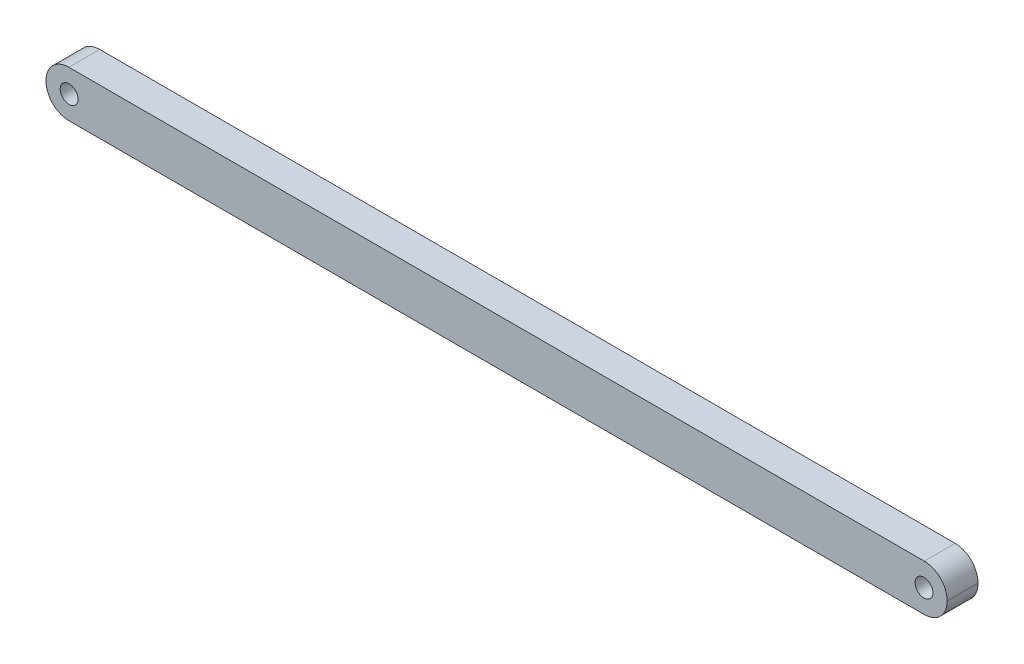
ISO-10303-21;
HEADER;
FILE_DESCRIPTION(('STEP AP214'),'2;1');
FILE_NAME('part.step','',(''),(''),'','','');
FILE_SCHEMA(('AUTOMOTIVE_DESIGN { 1 0 10303 214 1 1 1 1 }'));
ENDSEC;
DATA;
#1=APPLICATION_CONTEXT('core data for automotive mechanical design processes');
#2=APPLICATION_PROTOCOL_DEFINITION('international standard','automotive_design',2000,#1);
#3=PRODUCT_CONTEXT('',#1,'mechanical');
#4=PRODUCT('Part','Part','',(#3));
#5=PRODUCT_RELATED_PRODUCT_CATEGORY('part','',(#4));
#6=PRODUCT_DEFINITION_FORMATION('','',#4);
#7=PRODUCT_DEFINITION_CONTEXT('part definition',#1,'design');
#8=PRODUCT_DEFINITION('design','',#6,#7);
#9=PRODUCT_DEFINITION_SHAPE('','',#8);
#10=(LENGTH_UNIT() NAMED_UNIT(*) SI_UNIT(.MILLI.,.METRE.));
#11=(NAMED_UNIT(*) PLANE_ANGLE_UNIT() SI_UNIT($,.RADIAN.));
#12=(NAMED_UNIT(*) SI_UNIT($,.STERADIAN.) SOLID_ANGLE_UNIT());
#13=UNCERTAINTY_MEASURE_WITH_UNIT(LENGTH_MEASURE(1.E-05),#10,'distance_accuracy_value','');
#14=(GEOMETRIC_REPRESENTATION_CONTEXT(3) GLOBAL_UNCERTAINTY_ASSIGNED_CONTEXT((#13)) GLOBAL_UNIT_ASSIGNED_CONTEXT((#10,
#11,#12)) REPRESENTATION_CONTEXT('',''));
#15=CARTESIAN_POINT('',(0.,0.,0.));
#16=DIRECTION('',(0.,0.,1.));
#17=DIRECTION('',(1.,0.,0.));
#18=AXIS2_PLACEMENT_3D('',#15,#16,#17);
#19=CARTESIAN_POINT('',(-138.65,0.1,10.));
#20=DIRECTION('',(0.,0.,-1.));
#21=DIRECTION('',(-1.,0.,0.));
#22=AXIS2_PLACEMENT_3D('',#19,#20,#21);
#23=CYLINDRICAL_SURFACE('',#22,7.4);
#24=CARTESIAN_POINT('',(-138.65,0.1,0.));
#25=DIRECTION('',(0.,0.,1.));
#26=DIRECTION('',(1.,0.,0.));
#27=AXIS2_PLACEMENT_3D('',#24,#25,#26);
#28=CIRCLE('',#27,7.4);
#29=CARTESIAN_POINT('',(-146.05,0.0999999999999482,0.));
#30=VERTEX_POINT('',#29);
#31=CARTESIAN_POINT('',(-138.65,7.5,0.));
#32=VERTEX_POINT('',#31);
#33=EDGE_CURVE('E135',#30,#32,#28,.F.);
#34=ORIENTED_EDGE('',*,*,#33,.F.);
#35=DIRECTION('',(0.,0.,-1.));
#36=VECTOR('',#35,1.);
#37=CARTESIAN_POINT('',(-146.05,0.0999999999999482,10.));
#38=LINE('',#37,#36);
#39=CARTESIAN_POINT('',(-146.05,0.0999999999999482,10.));
#40=VERTEX_POINT('',#39);
#41=EDGE_CURVE('E11',#40,#30,#38,.T.);
#42=ORIENTED_EDGE('',*,*,#41,.F.);
#43=CARTESIAN_POINT('',(-138.65,0.1,10.));
#44=DIRECTION('',(0.,0.,1.));
#45=DIRECTION('',(1.,0.,0.));
#46=AXIS2_PLACEMENT_3D('',#43,#44,#45);
#47=CIRCLE('',#46,7.4);
#48=CARTESIAN_POINT('',(-138.65,7.5,10.));
#49=VERTEX_POINT('',#48);
#50=EDGE_CURVE('E189',#40,#49,#47,.F.);
#51=ORIENTED_EDGE('',*,*,#50,.T.);
#52=DIRECTION('',(0.,0.,-1.));
#53=VECTOR('',#52,1.);
#54=CARTESIAN_POINT('',(-138.65,7.5,10.));
#55=LINE('',#54,#53);
#56=EDGE_CURVE('E52',#49,#32,#55,.T.);
#57=ORIENTED_EDGE('',*,*,#56,.T.);
#58=EDGE_LOOP('',(#34,#42,#51,#57));
#59=FACE_BOUND('',#58,.T.);
#60=ADVANCED_FACE('F35',(#59),#23,.T.);
#61=CARTESIAN_POINT('',(-146.05,0.,10.));
#62=DIRECTION('',(-1.,0.,0.));
#63=DIRECTION('',(0.,0.,1.));
#64=AXIS2_PLACEMENT_3D('',#61,#62,#63);
#65=PLANE('',#64);
#66=DIRECTION('',(0.,1.,0.));
#67=VECTOR('',#66,1.);
#68=CARTESIAN_POINT('',(-146.05,0.,0.));
#69=LINE('',#68,#67);
#70=CARTESIAN_POINT('',(-146.05,-0.0999999999999474,0.));
#71=VERTEX_POINT('',#70);
#72=EDGE_CURVE('E137',#71,#30,#69,.T.);
#73=ORIENTED_EDGE('',*,*,#72,.F.);
#74=DIRECTION('',(0.,0.,-1.));
#75=VECTOR('',#74,1.);
#76=CARTESIAN_POINT('',(-146.05,-0.0999999999999474,10.));
#77=LINE('',#76,#75);
#78=CARTESIAN_POINT('',(-146.05,-0.0999999999999474,10.));
#79=VERTEX_POINT('',#78);
#80=EDGE_CURVE('E44',#79,#71,#77,.T.);
#81=ORIENTED_EDGE('',*,*,#80,.F.);
#82=DIRECTION('',(0.,1.,0.));
#83=VECTOR('',#82,1.);
#84=CARTESIAN_POINT('',(-146.05,0.,10.));
#85=LINE('',#84,#83);
#86=EDGE_CURVE('E187',#79,#40,#85,.T.);
#87=ORIENTED_EDGE('',*,*,#86,.T.);
#88=ORIENTED_EDGE('',*,*,#41,.T.);
#89=EDGE_LOOP('',(#73,#81,#87,#88));
#90=FACE_BOUND('',#89,.T.);
#91=ADVANCED_FACE('F176',(#90),#65,.T.);
#92=CARTESIAN_POINT('',(-138.65,-0.0999999999999985,10.));
#93=DIRECTION('',(0.,0.,-1.));
#94=DIRECTION('',(-1.,0.,0.));
#95=AXIS2_PLACEMENT_3D('',#92,#93,#94);
#96=CYLINDRICAL_SURFACE('',#95,7.4);
#97=CARTESIAN_POINT('',(-138.65,-0.0999999999999985,0.));
#98=DIRECTION('',(0.,0.,1.));
#99=DIRECTION('',(1.,0.,0.));
#100=AXIS2_PLACEMENT_3D('',#97,#98,#99);
#101=CIRCLE('',#100,7.4);
#102=CARTESIAN_POINT('',(-138.65,-7.5,0.));
#103=VERTEX_POINT('',#102);
#104=EDGE_CURVE('E140',#103,#71,#101,.F.);
#105=ORIENTED_EDGE('',*,*,#104,.F.);
#106=DIRECTION('',(0.,0.,-1.));
#107=VECTOR('',#106,1.);
#108=CARTESIAN_POINT('',(-138.65,-7.5,10.));
#109=LINE('',#108,#107);
#110=CARTESIAN_POINT('',(-138.65,-7.5,10.));
#111=VERTEX_POINT('',#110);
#112=EDGE_CURVE('E165',#111,#103,#109,.T.);
#113=ORIENTED_EDGE('',*,*,#112,.F.);
#114=CARTESIAN_POINT('',(-138.65,-0.0999999999999985,10.));
#115=DIRECTION('',(0.,0.,1.));
#116=DIRECTION('',(1.,0.,0.));
#117=AXIS2_PLACEMENT_3D('',#114,#115,#116);
#118=CIRCLE('',#117,7.4);
#119=EDGE_CURVE('E172',#111,#79,#118,.F.);
#120=ORIENTED_EDGE('',*,*,#119,.T.);
#121=ORIENTED_EDGE('',*,*,#80,.T.);
#122=EDGE_LOOP('',(#105,#113,#120,#121));
#123=FACE_BOUND('',#122,.T.);
#124=ADVANCED_FACE('F170',(#123),#96,.T.);
#125=CARTESIAN_POINT('',(0.,-7.5,10.));
#126=DIRECTION('',(0.,1.,0.));
#127=DIRECTION('',(0.,0.,1.));
#128=AXIS2_PLACEMENT_3D('',#125,#126,#127);
#129=PLANE('',#128);
#130=DIRECTION('',(1.,0.,0.));
#131=VECTOR('',#130,1.);
#132=CARTESIAN_POINT('',(0.,-7.5,0.));
#133=LINE('',#132,#131);
#134=CARTESIAN_POINT('',(138.65,-7.5,0.));
#135=VERTEX_POINT('',#134);
#136=EDGE_CURVE('E143',#103,#135,#133,.T.);
#137=ORIENTED_EDGE('',*,*,#136,.T.);
#138=DIRECTION('',(0.,0.,-1.));
#139=VECTOR('',#138,1.);
#140=CARTESIAN_POINT('',(138.65,-7.5,10.));
#141=LINE('',#140,#139);
#142=CARTESIAN_POINT('',(138.65,-7.5,10.));
#143=VERTEX_POINT('',#142);
#144=EDGE_CURVE('E162',#143,#135,#141,.T.);
#145=ORIENTED_EDGE('',*,*,#144,.F.);
#146=DIRECTION('',(1.,0.,0.));
#147=VECTOR('',#146,1.);
#148=CARTESIAN_POINT('',(0.,-7.5,10.));
#149=LINE('',#148,#147);
#150=EDGE_CURVE('E185',#111,#143,#149,.T.);
#151=ORIENTED_EDGE('',*,*,#150,.F.);
#152=ORIENTED_EDGE('',*,*,#112,.T.);
#153=EDGE_LOOP('',(#137,#145,#151,#152));
#154=FACE_BOUND('',#153,.T.);
#155=ADVANCED_FACE('F183',(#154),#129,.F.);
#156=CARTESIAN_POINT('',(138.65,-0.0999999999999985,10.));
#157=DIRECTION('',(0.,0.,-1.));
#158=DIRECTION('',(-1.,0.,0.));
#159=AXIS2_PLACEMENT_3D('',#156,#157,#158);
#160=CYLINDRICAL_SURFACE('',#159,7.4);
#161=CARTESIAN_POINT('',(138.65,-0.0999999999999985,0.));
#162=DIRECTION('',(0.,0.,1.));
#163=DIRECTION('',(1.,0.,0.));
#164=AXIS2_PLACEMENT_3D('',#161,#162,#163);
#165=CIRCLE('',#164,7.4);
#166=CARTESIAN_POINT('',(146.05,-0.0999999999999474,0.));
#167=VERTEX_POINT('',#166);
#168=EDGE_CURVE('E146',#135,#167,#165,.T.);
#169=ORIENTED_EDGE('',*,*,#168,.T.);
#170=DIRECTION('',(0.,0.,-1.));
#171=VECTOR('',#170,1.);
#172=CARTESIAN_POINT('',(146.05,-0.0999999999999474,10.));
#173=LINE('',#172,#171);
#174=CARTESIAN_POINT('',(146.05,-0.0999999999999474,10.));
#175=VERTEX_POINT('',#174);
#176=EDGE_CURVE('E121',#175,#167,#173,.T.);
#177=ORIENTED_EDGE('',*,*,#176,.F.);
#178=CARTESIAN_POINT('',(138.65,-0.0999999999999985,10.));
#179=DIRECTION('',(0.,0.,1.));
#180=DIRECTION('',(1.,0.,0.));
#181=AXIS2_PLACEMENT_3D('',#178,#179,#180);
#182=CIRCLE('',#181,7.4);
#183=EDGE_CURVE('E110',#143,#175,#182,.T.);
#184=ORIENTED_EDGE('',*,*,#183,.F.);
#185=ORIENTED_EDGE('',*,*,#144,.T.);
#186=EDGE_LOOP('',(#169,#177,#184,#185));
#187=FACE_BOUND('',#186,.T.);
#188=ADVANCED_FACE('F219',(#187),#160,.T.);
#189=CARTESIAN_POINT('',(146.05,0.,10.));
#190=DIRECTION('',(-1.,0.,0.));
#191=DIRECTION('',(0.,0.,1.));
#192=AXIS2_PLACEMENT_3D('',#189,#190,#191);
#193=PLANE('',#192);
#194=DIRECTION('',(0.,1.,0.));
#195=VECTOR('',#194,1.);
#196=CARTESIAN_POINT('',(146.05,0.,0.));
#197=LINE('',#196,#195);
#198=CARTESIAN_POINT('',(146.05,0.0999999999999482,0.));
#199=VERTEX_POINT('',#198);
#200=EDGE_CURVE('E118',#167,#199,#197,.T.);
#201=ORIENTED_EDGE('',*,*,#200,.T.);
#202=DIRECTION('',(0.,0.,-1.));
#203=VECTOR('',#202,1.);
#204=CARTESIAN_POINT('',(146.05,0.0999999999999482,10.));
#205=LINE('',#204,#203);
#206=CARTESIAN_POINT('',(146.05,0.0999999999999482,10.));
#207=VERTEX_POINT('',#206);
#208=EDGE_CURVE('E116',#207,#199,#205,.T.);
#209=ORIENTED_EDGE('',*,*,#208,.F.);
#210=DIRECTION('',(0.,1.,0.));
#211=VECTOR('',#210,1.);
#212=CARTESIAN_POINT('',(146.05,0.,10.));
#213=LINE('',#212,#211);
#214=EDGE_CURVE('E102',#175,#207,#213,.T.);
#215=ORIENTED_EDGE('',*,*,#214,.F.);
#216=ORIENTED_EDGE('',*,*,#176,.T.);
#217=EDGE_LOOP('',(#201,#209,#215,#216));
#218=FACE_BOUND('',#217,.T.);
#219=ADVANCED_FACE('F117',(#218),#193,.F.);
#220=CARTESIAN_POINT('',(138.65,0.1,10.));
#221=DIRECTION('',(0.,0.,-1.));
#222=DIRECTION('',(-1.,0.,0.));
#223=AXIS2_PLACEMENT_3D('',#220,#221,#222);
#224=CYLINDRICAL_SURFACE('',#223,7.4);
#225=CARTESIAN_POINT('',(138.65,0.1,0.));
#226=DIRECTION('',(0.,0.,1.));
#227=DIRECTION('',(1.,0.,0.));
#228=AXIS2_PLACEMENT_3D('',#225,#226,#227);
#229=CIRCLE('',#228,7.4);
#230=CARTESIAN_POINT('',(138.65,7.5,0.));
#231=VERTEX_POINT('',#230);
#232=EDGE_CURVE('E150',#231,#199,#229,.F.);
#233=ORIENTED_EDGE('',*,*,#232,.F.);
#234=DIRECTION('',(0.,0.,-1.));
#235=VECTOR('',#234,1.);
#236=CARTESIAN_POINT('',(138.65,7.5,10.));
#237=LINE('',#236,#235);
#238=CARTESIAN_POINT('',(138.65,7.5,10.));
#239=VERTEX_POINT('',#238);
#240=EDGE_CURVE('E77',#239,#231,#237,.T.);
#241=ORIENTED_EDGE('',*,*,#240,.F.);
#242=CARTESIAN_POINT('',(138.65,0.1,10.));
#243=DIRECTION('',(0.,0.,1.));
#244=DIRECTION('',(1.,0.,0.));
#245=AXIS2_PLACEMENT_3D('',#242,#243,#244);
#246=CIRCLE('',#245,7.4);
#247=EDGE_CURVE('E108',#239,#207,#246,.F.);
#248=ORIENTED_EDGE('',*,*,#247,.T.);
#249=ORIENTED_EDGE('',*,*,#208,.T.);
#250=EDGE_LOOP('',(#233,#241,#248,#249));
#251=FACE_BOUND('',#250,.T.);
#252=ADVANCED_FACE('F123',(#251),#224,.T.);
#253=CARTESIAN_POINT('',(0.,7.5,10.));
#254=DIRECTION('',(0.,1.,0.));
#255=DIRECTION('',(0.,0.,1.));
#256=AXIS2_PLACEMENT_3D('',#253,#254,#255);
#257=PLANE('',#256);
#258=DIRECTION('',(1.,0.,0.));
#259=VECTOR('',#258,1.);
#260=CARTESIAN_POINT('',(0.,7.5,0.));
#261=LINE('',#260,#259);
#262=EDGE_CURVE('E152',#32,#231,#261,.T.);
#263=ORIENTED_EDGE('',*,*,#262,.F.);
#264=ORIENTED_EDGE('',*,*,#56,.F.);
#265=DIRECTION('',(1.,0.,0.));
#266=VECTOR('',#265,1.);
#267=CARTESIAN_POINT('',(0.,7.5,10.));
#268=LINE('',#267,#266);
#269=EDGE_CURVE('E124',#49,#239,#268,.T.);
#270=ORIENTED_EDGE('',*,*,#269,.T.);
#271=ORIENTED_EDGE('',*,*,#240,.T.);
#272=EDGE_LOOP('',(#263,#264,#270,#271));
#273=FACE_BOUND('',#272,.T.);
#274=ADVANCED_FACE('F227',(#273),#257,.T.);
#275=CARTESIAN_POINT('',(-138.55,0.,10.));
#276=DIRECTION('',(0.,0.,-1.));
#277=DIRECTION('',(-1.,0.,0.));
#278=AXIS2_PLACEMENT_3D('',#275,#276,#277);
#279=CYLINDRICAL_SURFACE('',#278,2.9);
#280=CARTESIAN_POINT('',(-138.55,0.,10.));
#281=DIRECTION('',(0.,0.,1.));
#282=DIRECTION('',(1.,0.,0.));
#283=AXIS2_PLACEMENT_3D('',#280,#281,#282);
#284=CIRCLE('',#283,2.9);
#285=CARTESIAN_POINT('',(-135.65,0.,10.));
#286=VERTEX_POINT('',#285);
#287=EDGE_CURVE('E158',#286,#286,#284,.T.);
#288=ORIENTED_EDGE('',*,*,#287,.T.);
#289=EDGE_LOOP('',(#288));
#290=FACE_BOUND('',#289,.T.);
#291=CARTESIAN_POINT('',(-138.55,0.,0.));
#292=DIRECTION('',(0.,0.,1.));
#293=DIRECTION('',(1.,0.,0.));
#294=AXIS2_PLACEMENT_3D('',#291,#292,#293);
#295=CIRCLE('',#294,2.9);
#296=CARTESIAN_POINT('',(-135.65,0.,0.));
#297=VERTEX_POINT('',#296);
#298=EDGE_CURVE('E132',#297,#297,#295,.T.);
#299=ORIENTED_EDGE('',*,*,#298,.F.);
#300=EDGE_LOOP('',(#299));
#301=FACE_BOUND('',#300,.T.);
#302=ADVANCED_FACE('F37',(#290,#301),#279,.F.);
#303=CARTESIAN_POINT('',(138.55,0.,10.));
#304=DIRECTION('',(0.,0.,-1.));
#305=DIRECTION('',(-1.,0.,0.));
#306=AXIS2_PLACEMENT_3D('',#303,#304,#305);
#307=CYLINDRICAL_SURFACE('',#306,2.9000000000017);
#308=CARTESIAN_POINT('',(138.55,0.,10.));
#309=DIRECTION('',(0.,0.,1.));
#310=DIRECTION('',(1.,0.,0.));
#311=AXIS2_PLACEMENT_3D('',#308,#309,#310);
#312=CIRCLE('',#311,2.9000000000017);
#313=CARTESIAN_POINT('',(141.450000000002,0.,10.));
#314=VERTEX_POINT('',#313);
#315=EDGE_CURVE('E126',#314,#314,#312,.F.);
#316=ORIENTED_EDGE('',*,*,#315,.F.);
#317=EDGE_LOOP('',(#316));
#318=FACE_BOUND('',#317,.T.);
#319=CARTESIAN_POINT('',(138.55,0.,0.));
#320=DIRECTION('',(0.,0.,1.));
#321=DIRECTION('',(1.,0.,0.));
#322=AXIS2_PLACEMENT_3D('',#319,#320,#321);
#323=CIRCLE('',#322,2.9000000000017);
#324=CARTESIAN_POINT('',(141.450000000002,0.,0.));
#325=VERTEX_POINT('',#324);
#326=EDGE_CURVE('E155',#325,#325,#323,.F.);
#327=ORIENTED_EDGE('',*,*,#326,.T.);
#328=EDGE_LOOP('',(#327));
#329=FACE_BOUND('',#328,.T.);
#330=ADVANCED_FACE('F199',(#318,#329),#307,.F.);
#331=CARTESIAN_POINT('',(0.,0.,10.));
#332=DIRECTION('',(0.,0.,1.));
#333=DIRECTION('',(1.,0.,0.));
#334=AXIS2_PLACEMENT_3D('',#331,#332,#333);
#335=PLANE('',#334);
#336=ORIENTED_EDGE('',*,*,#287,.F.);
#337=EDGE_LOOP('',(#336));
#338=FACE_BOUND('',#337,.T.);
#339=ORIENTED_EDGE('',*,*,#50,.F.);
#340=ORIENTED_EDGE('',*,*,#86,.F.);
#341=ORIENTED_EDGE('',*,*,#119,.F.);
#342=ORIENTED_EDGE('',*,*,#150,.T.);
#343=ORIENTED_EDGE('',*,*,#183,.T.);
#344=ORIENTED_EDGE('',*,*,#214,.T.);
#345=ORIENTED_EDGE('',*,*,#247,.F.);
#346=ORIENTED_EDGE('',*,*,#269,.F.);
#347=EDGE_LOOP('',(#339,#340,#341,#342,#343,#344,#345,#346));
#348=FACE_BOUND('',#347,.T.);
#349=ORIENTED_EDGE('',*,*,#315,.T.);
#350=EDGE_LOOP('',(#349));
#351=FACE_BOUND('',#350,.T.);
#352=ADVANCED_FACE('F104',(#338,#348,#351),#335,.T.);
#353=CARTESIAN_POINT('',(0.,0.,0.));
#354=DIRECTION('',(0.,0.,1.));
#355=DIRECTION('',(1.,0.,0.));
#356=AXIS2_PLACEMENT_3D('',#353,#354,#355);
#357=PLANE('',#356);
#358=ORIENTED_EDGE('',*,*,#298,.T.);
#359=EDGE_LOOP('',(#358));
#360=FACE_BOUND('',#359,.T.);
#361=ORIENTED_EDGE('',*,*,#33,.T.);
#362=ORIENTED_EDGE('',*,*,#262,.T.);
#363=ORIENTED_EDGE('',*,*,#232,.T.);
#364=ORIENTED_EDGE('',*,*,#200,.F.);
#365=ORIENTED_EDGE('',*,*,#168,.F.);
#366=ORIENTED_EDGE('',*,*,#136,.F.);
#367=ORIENTED_EDGE('',*,*,#104,.T.);
#368=ORIENTED_EDGE('',*,*,#72,.T.);
#369=EDGE_LOOP('',(#361,#362,#363,#364,#365,#366,#367,#368));
#370=FACE_BOUND('',#369,.T.);
#371=ORIENTED_EDGE('',*,*,#326,.F.);
#372=EDGE_LOOP('',(#371));
#373=FACE_BOUND('',#372,.T.);
#374=ADVANCED_FACE('F179',(#360,#370,#373),#357,.F.);
#375=CLOSED_SHELL('',(#60,#91,#124,#155,#188,#219,#252,#274,#302,#330,#352,#374));
#376=MANIFOLD_SOLID_BREP('B2',#375);
#377=ADVANCED_BREP_SHAPE_REPRESENTATION('',(#18,#376),#14);
#378=SHAPE_DEFINITION_REPRESENTATION(#9,#377);
ENDSEC;
END-ISO-10303-21;
